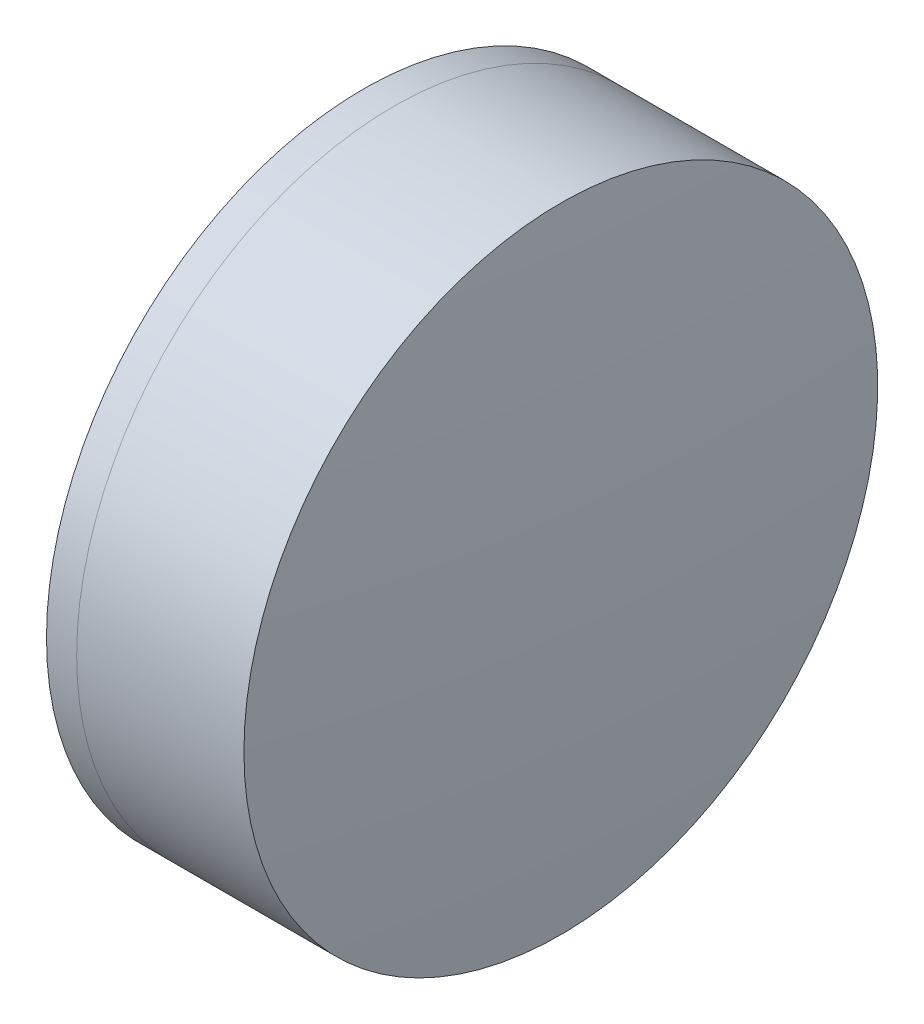
ISO-10303-21;
HEADER;
FILE_DESCRIPTION(('STEP AP214'),'2;1');
FILE_NAME('part.step','',(''),(''),'','','');
FILE_SCHEMA(('AUTOMOTIVE_DESIGN { 1 0 10303 214 1 1 1 1 }'));
ENDSEC;
DATA;
#1=APPLICATION_CONTEXT('core data for automotive mechanical design processes');
#2=APPLICATION_PROTOCOL_DEFINITION('international standard','automotive_design',2000,#1);
#3=PRODUCT_CONTEXT('',#1,'mechanical');
#4=PRODUCT('Part','Part','',(#3));
#5=PRODUCT_RELATED_PRODUCT_CATEGORY('part','',(#4));
#6=PRODUCT_DEFINITION_FORMATION('','',#4);
#7=PRODUCT_DEFINITION_CONTEXT('part definition',#1,'design');
#8=PRODUCT_DEFINITION('design','',#6,#7);
#9=PRODUCT_DEFINITION_SHAPE('','',#8);
#10=(LENGTH_UNIT() NAMED_UNIT(*) SI_UNIT(.MILLI.,.METRE.));
#11=(NAMED_UNIT(*) PLANE_ANGLE_UNIT() SI_UNIT($,.RADIAN.));
#12=(NAMED_UNIT(*) SI_UNIT($,.STERADIAN.) SOLID_ANGLE_UNIT());
#13=UNCERTAINTY_MEASURE_WITH_UNIT(LENGTH_MEASURE(1.E-05),#10,'distance_accuracy_value','');
#14=(GEOMETRIC_REPRESENTATION_CONTEXT(3) GLOBAL_UNCERTAINTY_ASSIGNED_CONTEXT((#13)) GLOBAL_UNIT_ASSIGNED_CONTEXT((#10,
#11,#12)) REPRESENTATION_CONTEXT('',''));
#15=CARTESIAN_POINT('',(0.,0.,0.));
#16=DIRECTION('',(0.,0.,1.));
#17=DIRECTION('',(1.,0.,0.));
#18=AXIS2_PLACEMENT_3D('',#15,#16,#17);
#19=CARTESIAN_POINT('',(260.70895665047,0.,0.));
#20=DIRECTION('',(-1.,0.,0.));
#21=DIRECTION('',(0.,0.,1.));
#22=AXIS2_PLACEMENT_3D('',#19,#20,#21);
#23=SPHERICAL_SURFACE('',#22,10.6);
#24=CARTESIAN_POINT('',(269.196447445752,0.,0.));
#25=DIRECTION('',(-1.,0.,0.));
#26=DIRECTION('',(0.,0.,1.));
#27=AXIS2_PLACEMENT_3D('',#24,#25,#26);
#28=CIRCLE('',#27,6.35);
#29=CARTESIAN_POINT('',(269.196447445752,0.,6.35));
#30=VERTEX_POINT('',#29);
#31=EDGE_CURVE('E11',#30,#30,#28,.T.);
#32=ORIENTED_EDGE('',*,*,#31,.T.);
#33=EDGE_LOOP('',(#32));
#34=FACE_BOUND('',#33,.T.);
#35=ADVANCED_FACE('F45',(#34),#23,.F.);
#36=CARTESIAN_POINT('',(-0.551919992657797,0.,0.));
#37=DIRECTION('',(-1.,0.,0.));
#38=DIRECTION('',(0.,0.,1.));
#39=AXIS2_PLACEMENT_3D('',#36,#37,#38);
#40=CYLINDRICAL_SURFACE('',#39,6.35);
#41=CARTESIAN_POINT('',(272.54803559234,0.,0.));
#42=DIRECTION('',(-1.,0.,0.));
#43=DIRECTION('',(0.,0.,1.));
#44=AXIS2_PLACEMENT_3D('',#41,#42,#43);
#45=CIRCLE('',#44,6.35);
#46=CARTESIAN_POINT('',(272.54803559234,0.,6.35));
#47=VERTEX_POINT('',#46);
#48=EDGE_CURVE('E51',#47,#47,#45,.T.);
#49=ORIENTED_EDGE('',*,*,#48,.T.);
#50=EDGE_LOOP('',(#49));
#51=FACE_BOUND('',#50,.T.);
#52=ORIENTED_EDGE('',*,*,#31,.F.);
#53=EDGE_LOOP('',(#52));
#54=FACE_BOUND('',#53,.T.);
#55=ADVANCED_FACE('F57',(#51,#54),#40,.T.);
#56=CARTESIAN_POINT('',(195.40895665047,0.,0.));
#57=DIRECTION('',(-1.,0.,0.));
#58=DIRECTION('',(0.,0.,1.));
#59=AXIS2_PLACEMENT_3D('',#56,#57,#58);
#60=SPHERICAL_SURFACE('',#59,77.4);
#61=ORIENTED_EDGE('',*,*,#48,.F.);
#62=EDGE_LOOP('',(#61));
#63=FACE_BOUND('',#62,.T.);
#64=ADVANCED_FACE('F60',(#63),#60,.T.);
#65=CLOSED_SHELL('',(#35,#55,#64));
#66=MANIFOLD_SOLID_BREP('B2',#65);
#67=CARTESIAN_POINT('',(279.00895665047,0.,0.));
#68=DIRECTION('',(-1.,0.,0.));
#69=DIRECTION('',(0.,0.,1.));
#70=AXIS2_PLACEMENT_3D('',#67,#68,#69);
#71=SPHERICAL_SURFACE('',#70,12.2000000000005);
#72=CARTESIAN_POINT('',(268.591783329458,0.,0.));
#73=DIRECTION('',(-1.,0.,0.));
#74=DIRECTION('',(0.,0.,1.));
#75=AXIS2_PLACEMENT_3D('',#72,#73,#74);
#76=CIRCLE('',#75,6.35);
#77=CARTESIAN_POINT('',(268.591783329458,0.,6.35));
#78=VERTEX_POINT('',#77);
#79=EDGE_CURVE('E44',#78,#78,#76,.T.);
#80=ORIENTED_EDGE('',*,*,#79,.T.);
#81=EDGE_LOOP('',(#80));
#82=FACE_BOUND('',#81,.T.);
#83=ADVANCED_FACE('F86',(#82),#71,.T.);
#84=CARTESIAN_POINT('',(124.523309526045,0.,0.));
#85=DIRECTION('',(-1.,0.,0.));
#86=DIRECTION('',(0.,0.,1.));
#87=AXIS2_PLACEMENT_3D('',#84,#85,#86);
#88=CYLINDRICAL_SURFACE('',#87,6.35);
#89=CARTESIAN_POINT('',(269.196447445752,0.,0.));
#90=DIRECTION('',(-1.,0.,0.));
#91=DIRECTION('',(0.,0.,1.));
#92=AXIS2_PLACEMENT_3D('',#89,#90,#91);
#93=CIRCLE('',#92,6.35);
#94=CARTESIAN_POINT('',(269.196447445752,0.,6.35));
#95=VERTEX_POINT('',#94);
#96=EDGE_CURVE('E92',#95,#95,#93,.T.);
#97=ORIENTED_EDGE('',*,*,#96,.T.);
#98=EDGE_LOOP('',(#97));
#99=FACE_BOUND('',#98,.T.);
#100=ORIENTED_EDGE('',*,*,#79,.F.);
#101=EDGE_LOOP('',(#100));
#102=FACE_BOUND('',#101,.T.);
#103=ADVANCED_FACE('F98',(#99,#102),#88,.T.);
#104=CARTESIAN_POINT('',(260.70895665047,0.,0.));
#105=DIRECTION('',(-1.,0.,0.));
#106=DIRECTION('',(0.,0.,1.));
#107=AXIS2_PLACEMENT_3D('',#104,#105,#106);
#108=SPHERICAL_SURFACE('',#107,10.6);
#109=ORIENTED_EDGE('',*,*,#96,.F.);
#110=EDGE_LOOP('',(#109));
#111=FACE_BOUND('',#110,.T.);
#112=ADVANCED_FACE('F101',(#111),#108,.T.);
#113=CLOSED_SHELL('',(#83,#103,#112));
#114=MANIFOLD_SOLID_BREP('B6',#113);
#115=ADVANCED_BREP_SHAPE_REPRESENTATION('',(#18,#66,#114),#14);
#116=SHAPE_DEFINITION_REPRESENTATION(#9,#115);
ENDSEC;
END-ISO-10303-21;
